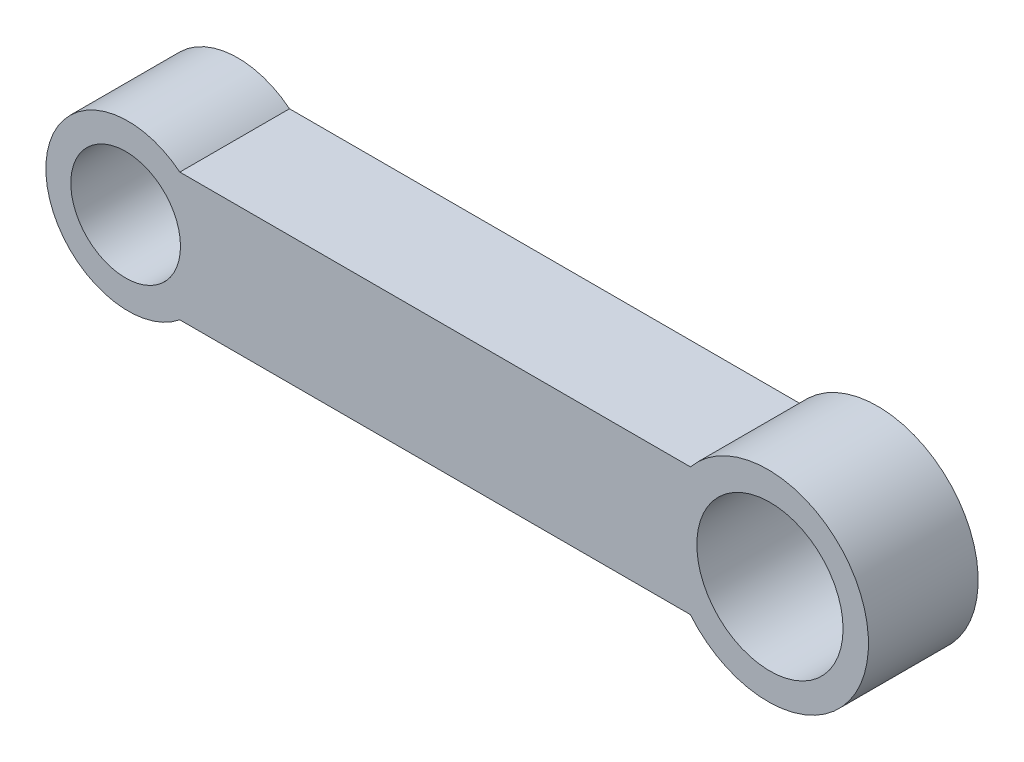
ISO-10303-21;
HEADER;
FILE_DESCRIPTION(('STEP AP214'),'2;1');
FILE_NAME('part.step','',(''),(''),'','','');
FILE_SCHEMA(('AUTOMOTIVE_DESIGN { 1 0 10303 214 1 1 1 1 }'));
ENDSEC;
DATA;
#1=APPLICATION_CONTEXT('core data for automotive mechanical design processes');
#2=APPLICATION_PROTOCOL_DEFINITION('international standard','automotive_design',2000,#1);
#3=PRODUCT_CONTEXT('',#1,'mechanical');
#4=PRODUCT('Part','Part','',(#3));
#5=PRODUCT_RELATED_PRODUCT_CATEGORY('part','',(#4));
#6=PRODUCT_DEFINITION_FORMATION('','',#4);
#7=PRODUCT_DEFINITION_CONTEXT('part definition',#1,'design');
#8=PRODUCT_DEFINITION('design','',#6,#7);
#9=PRODUCT_DEFINITION_SHAPE('','',#8);
#10=(LENGTH_UNIT() NAMED_UNIT(*) SI_UNIT(.MILLI.,.METRE.));
#11=(NAMED_UNIT(*) PLANE_ANGLE_UNIT() SI_UNIT($,.RADIAN.));
#12=(NAMED_UNIT(*) SI_UNIT($,.STERADIAN.) SOLID_ANGLE_UNIT());
#13=UNCERTAINTY_MEASURE_WITH_UNIT(LENGTH_MEASURE(1.E-05),#10,'distance_accuracy_value','');
#14=(GEOMETRIC_REPRESENTATION_CONTEXT(3) GLOBAL_UNCERTAINTY_ASSIGNED_CONTEXT((#13)) GLOBAL_UNIT_ASSIGNED_CONTEXT((#10,
#11,#12)) REPRESENTATION_CONTEXT('',''));
#15=CARTESIAN_POINT('',(0.,0.,0.));
#16=DIRECTION('',(0.,0.,1.));
#17=DIRECTION('',(1.,0.,0.));
#18=AXIS2_PLACEMENT_3D('',#15,#16,#17);
#19=CARTESIAN_POINT('',(-16.856,0.,6.));
#20=DIRECTION('',(0.,0.,-1.));
#21=DIRECTION('',(-1.,0.,0.));
#22=AXIS2_PLACEMENT_3D('',#19,#20,#21);
#23=CYLINDRICAL_SURFACE('',#22,4.5);
#24=CARTESIAN_POINT('',(-16.856,0.,0.));
#25=DIRECTION('',(0.,0.,1.));
#26=DIRECTION('',(1.,0.,0.));
#27=AXIS2_PLACEMENT_3D('',#24,#25,#26);
#28=CIRCLE('',#27,4.5);
#29=CARTESIAN_POINT('',(-14.0275728752538,3.5,0.));
#30=VERTEX_POINT('',#29);
#31=CARTESIAN_POINT('',(-14.0275728752538,-3.5,0.));
#32=VERTEX_POINT('',#31);
#33=EDGE_CURVE('E109',#30,#32,#28,.T.);
#34=ORIENTED_EDGE('',*,*,#33,.T.);
#35=DIRECTION('',(0.,0.,-1.));
#36=VECTOR('',#35,1.);
#37=CARTESIAN_POINT('',(-14.0275728752538,-3.5,6.));
#38=LINE('',#37,#36);
#39=CARTESIAN_POINT('',(-14.0275728752538,-3.5,6.));
#40=VERTEX_POINT('',#39);
#41=EDGE_CURVE('E11',#40,#32,#38,.T.);
#42=ORIENTED_EDGE('',*,*,#41,.F.);
#43=CARTESIAN_POINT('',(-16.856,0.,6.));
#44=DIRECTION('',(0.,0.,1.));
#45=DIRECTION('',(1.,0.,0.));
#46=AXIS2_PLACEMENT_3D('',#43,#44,#45);
#47=CIRCLE('',#46,4.5);
#48=CARTESIAN_POINT('',(-14.0275728752538,3.5,6.));
#49=VERTEX_POINT('',#48);
#50=EDGE_CURVE('E91',#49,#40,#47,.T.);
#51=ORIENTED_EDGE('',*,*,#50,.F.);
#52=DIRECTION('',(0.,0.,-1.));
#53=VECTOR('',#52,1.);
#54=CARTESIAN_POINT('',(-14.0275728752538,3.5,6.));
#55=LINE('',#54,#53);
#56=EDGE_CURVE('E58',#49,#30,#55,.T.);
#57=ORIENTED_EDGE('',*,*,#56,.T.);
#58=EDGE_LOOP('',(#34,#42,#51,#57));
#59=FACE_BOUND('',#58,.T.);
#60=ADVANCED_FACE('F41',(#59),#23,.T.);
#61=CARTESIAN_POINT('',(0.,-3.5,6.));
#62=DIRECTION('',(0.,1.,0.));
#63=DIRECTION('',(0.,0.,1.));
#64=AXIS2_PLACEMENT_3D('',#61,#62,#63);
#65=PLANE('',#64);
#66=DIRECTION('',(1.,0.,0.));
#67=VECTOR('',#66,1.);
#68=CARTESIAN_POINT('',(0.,-3.5,0.));
#69=LINE('',#68,#67);
#70=CARTESIAN_POINT('',(13.9013593128808,-3.5,0.));
#71=VERTEX_POINT('',#70);
#72=EDGE_CURVE('E97',#32,#71,#69,.T.);
#73=ORIENTED_EDGE('',*,*,#72,.T.);
#74=DIRECTION('',(0.,0.,-1.));
#75=VECTOR('',#74,1.);
#76=CARTESIAN_POINT('',(13.9013593128808,-3.5,6.));
#77=LINE('',#76,#75);
#78=CARTESIAN_POINT('',(13.9013593128808,-3.5,6.));
#79=VERTEX_POINT('',#78);
#80=EDGE_CURVE('E50',#79,#71,#77,.T.);
#81=ORIENTED_EDGE('',*,*,#80,.F.);
#82=DIRECTION('',(1.,0.,0.));
#83=VECTOR('',#82,1.);
#84=CARTESIAN_POINT('',(0.,-3.5,6.));
#85=LINE('',#84,#83);
#86=EDGE_CURVE('E84',#40,#79,#85,.T.);
#87=ORIENTED_EDGE('',*,*,#86,.F.);
#88=ORIENTED_EDGE('',*,*,#41,.T.);
#89=EDGE_LOOP('',(#73,#81,#87,#88));
#90=FACE_BOUND('',#89,.T.);
#91=ADVANCED_FACE('F96',(#90),#65,.F.);
#92=CARTESIAN_POINT('',(18.144,0.,6.));
#93=DIRECTION('',(0.,0.,-1.));
#94=DIRECTION('',(-1.,0.,0.));
#95=AXIS2_PLACEMENT_3D('',#92,#93,#94);
#96=CYLINDRICAL_SURFACE('',#95,5.5);
#97=CARTESIAN_POINT('',(18.144,0.,0.));
#98=DIRECTION('',(0.,0.,1.));
#99=DIRECTION('',(1.,0.,0.));
#100=AXIS2_PLACEMENT_3D('',#97,#98,#99);
#101=CIRCLE('',#100,5.5);
#102=CARTESIAN_POINT('',(13.9013593128808,3.5,0.));
#103=VERTEX_POINT('',#102);
#104=EDGE_CURVE('E115',#71,#103,#101,.T.);
#105=ORIENTED_EDGE('',*,*,#104,.T.);
#106=DIRECTION('',(0.,0.,-1.));
#107=VECTOR('',#106,1.);
#108=CARTESIAN_POINT('',(13.9013593128808,3.5,6.));
#109=LINE('',#108,#107);
#110=CARTESIAN_POINT('',(13.9013593128808,3.5,6.));
#111=VERTEX_POINT('',#110);
#112=EDGE_CURVE('E73',#111,#103,#109,.T.);
#113=ORIENTED_EDGE('',*,*,#112,.F.);
#114=CARTESIAN_POINT('',(18.144,0.,6.));
#115=DIRECTION('',(0.,0.,1.));
#116=DIRECTION('',(1.,0.,0.));
#117=AXIS2_PLACEMENT_3D('',#114,#115,#116);
#118=CIRCLE('',#117,5.5);
#119=EDGE_CURVE('E90',#79,#111,#118,.T.);
#120=ORIENTED_EDGE('',*,*,#119,.F.);
#121=ORIENTED_EDGE('',*,*,#80,.T.);
#122=EDGE_LOOP('',(#105,#113,#120,#121));
#123=FACE_BOUND('',#122,.T.);
#124=ADVANCED_FACE('F101',(#123),#96,.T.);
#125=CARTESIAN_POINT('',(0.,3.5,6.));
#126=DIRECTION('',(0.,1.,0.));
#127=DIRECTION('',(0.,0.,1.));
#128=AXIS2_PLACEMENT_3D('',#125,#126,#127);
#129=PLANE('',#128);
#130=DIRECTION('',(1.,0.,0.));
#131=VECTOR('',#130,1.);
#132=CARTESIAN_POINT('',(0.,3.5,0.));
#133=LINE('',#132,#131);
#134=EDGE_CURVE('E118',#30,#103,#133,.T.);
#135=ORIENTED_EDGE('',*,*,#134,.F.);
#136=ORIENTED_EDGE('',*,*,#56,.F.);
#137=DIRECTION('',(1.,0.,0.));
#138=VECTOR('',#137,1.);
#139=CARTESIAN_POINT('',(0.,3.5,6.));
#140=LINE('',#139,#138);
#141=EDGE_CURVE('E103',#49,#111,#140,.T.);
#142=ORIENTED_EDGE('',*,*,#141,.T.);
#143=ORIENTED_EDGE('',*,*,#112,.T.);
#144=EDGE_LOOP('',(#135,#136,#142,#143));
#145=FACE_BOUND('',#144,.T.);
#146=ADVANCED_FACE('F156',(#145),#129,.T.);
#147=CARTESIAN_POINT('',(0.,0.,6.));
#148=DIRECTION('',(0.,0.,1.));
#149=DIRECTION('',(1.,0.,0.));
#150=AXIS2_PLACEMENT_3D('',#147,#148,#149);
#151=PLANE('',#150);
#152=CARTESIAN_POINT('',(-16.9910611446451,0.,6.));
#153=DIRECTION('',(0.,0.,1.));
#154=DIRECTION('',(1.,0.,0.));
#155=AXIS2_PLACEMENT_3D('',#152,#153,#154);
#156=CIRCLE('',#155,3.);
#157=CARTESIAN_POINT('',(-13.9910611446451,0.,6.));
#158=VERTEX_POINT('',#157);
#159=EDGE_CURVE('E136',#158,#158,#156,.T.);
#160=ORIENTED_EDGE('',*,*,#159,.F.);
#161=EDGE_LOOP('',(#160));
#162=FACE_BOUND('',#161,.T.);
#163=CARTESIAN_POINT('',(18.2535739049979,0.,6.));
#164=DIRECTION('',(0.,0.,1.));
#165=DIRECTION('',(1.,0.,0.));
#166=AXIS2_PLACEMENT_3D('',#163,#164,#165);
#167=CIRCLE('',#166,4.);
#168=CARTESIAN_POINT('',(22.2535739049979,0.,6.));
#169=VERTEX_POINT('',#168);
#170=EDGE_CURVE('E132',#169,#169,#167,.T.);
#171=ORIENTED_EDGE('',*,*,#170,.F.);
#172=EDGE_LOOP('',(#171));
#173=FACE_BOUND('',#172,.T.);
#174=ORIENTED_EDGE('',*,*,#50,.T.);
#175=ORIENTED_EDGE('',*,*,#86,.T.);
#176=ORIENTED_EDGE('',*,*,#119,.T.);
#177=ORIENTED_EDGE('',*,*,#141,.F.);
#178=EDGE_LOOP('',(#174,#175,#176,#177));
#179=FACE_BOUND('',#178,.T.);
#180=ADVANCED_FACE('F87',(#162,#173,#179),#151,.T.);
#181=CARTESIAN_POINT('',(0.,0.,0.));
#182=DIRECTION('',(0.,0.,1.));
#183=DIRECTION('',(1.,0.,0.));
#184=AXIS2_PLACEMENT_3D('',#181,#182,#183);
#185=PLANE('',#184);
#186=CARTESIAN_POINT('',(-16.9910611446451,0.,0.));
#187=DIRECTION('',(0.,0.,1.));
#188=DIRECTION('',(1.,0.,0.));
#189=AXIS2_PLACEMENT_3D('',#186,#187,#188);
#190=CIRCLE('',#189,3.);
#191=CARTESIAN_POINT('',(-13.9910611446451,0.,0.));
#192=VERTEX_POINT('',#191);
#193=EDGE_CURVE('E112',#192,#192,#190,.T.);
#194=ORIENTED_EDGE('',*,*,#193,.T.);
#195=EDGE_LOOP('',(#194));
#196=FACE_BOUND('',#195,.T.);
#197=CARTESIAN_POINT('',(18.2535739049979,0.,0.));
#198=DIRECTION('',(0.,0.,1.));
#199=DIRECTION('',(1.,0.,0.));
#200=AXIS2_PLACEMENT_3D('',#197,#198,#199);
#201=CIRCLE('',#200,4.);
#202=CARTESIAN_POINT('',(22.2535739049979,0.,0.));
#203=VERTEX_POINT('',#202);
#204=EDGE_CURVE('E128',#203,#203,#201,.T.);
#205=ORIENTED_EDGE('',*,*,#204,.T.);
#206=EDGE_LOOP('',(#205));
#207=FACE_BOUND('',#206,.T.);
#208=ORIENTED_EDGE('',*,*,#33,.F.);
#209=ORIENTED_EDGE('',*,*,#134,.T.);
#210=ORIENTED_EDGE('',*,*,#104,.F.);
#211=ORIENTED_EDGE('',*,*,#72,.F.);
#212=EDGE_LOOP('',(#208,#209,#210,#211));
#213=FACE_BOUND('',#212,.T.);
#214=ADVANCED_FACE('F144',(#196,#207,#213),#185,.F.);
#215=CARTESIAN_POINT('',(18.2535739049979,0.,0.));
#216=DIRECTION('',(0.,0.,1.));
#217=DIRECTION('',(1.,0.,0.));
#218=AXIS2_PLACEMENT_3D('',#215,#216,#217);
#219=CYLINDRICAL_SURFACE('',#218,4.);
#220=ORIENTED_EDGE('',*,*,#204,.F.);
#221=EDGE_LOOP('',(#220));
#222=FACE_BOUND('',#221,.T.);
#223=ORIENTED_EDGE('',*,*,#170,.T.);
#224=EDGE_LOOP('',(#223));
#225=FACE_BOUND('',#224,.T.);
#226=ADVANCED_FACE('F150',(#222,#225),#219,.F.);
#227=CARTESIAN_POINT('',(-16.9910611446451,0.,0.));
#228=DIRECTION('',(0.,0.,1.));
#229=DIRECTION('',(1.,0.,0.));
#230=AXIS2_PLACEMENT_3D('',#227,#228,#229);
#231=CYLINDRICAL_SURFACE('',#230,3.);
#232=ORIENTED_EDGE('',*,*,#193,.F.);
#233=EDGE_LOOP('',(#232));
#234=FACE_BOUND('',#233,.T.);
#235=ORIENTED_EDGE('',*,*,#159,.T.);
#236=EDGE_LOOP('',(#235));
#237=FACE_BOUND('',#236,.T.);
#238=ADVANCED_FACE('F147',(#234,#237),#231,.F.);
#239=CLOSED_SHELL('',(#60,#91,#124,#146,#180,#214,#226,#238));
#240=MANIFOLD_SOLID_BREP('B2',#239);
#241=ADVANCED_BREP_SHAPE_REPRESENTATION('',(#18,#240),#14);
#242=SHAPE_DEFINITION_REPRESENTATION(#9,#241);
ENDSEC;
END-ISO-10303-21;
